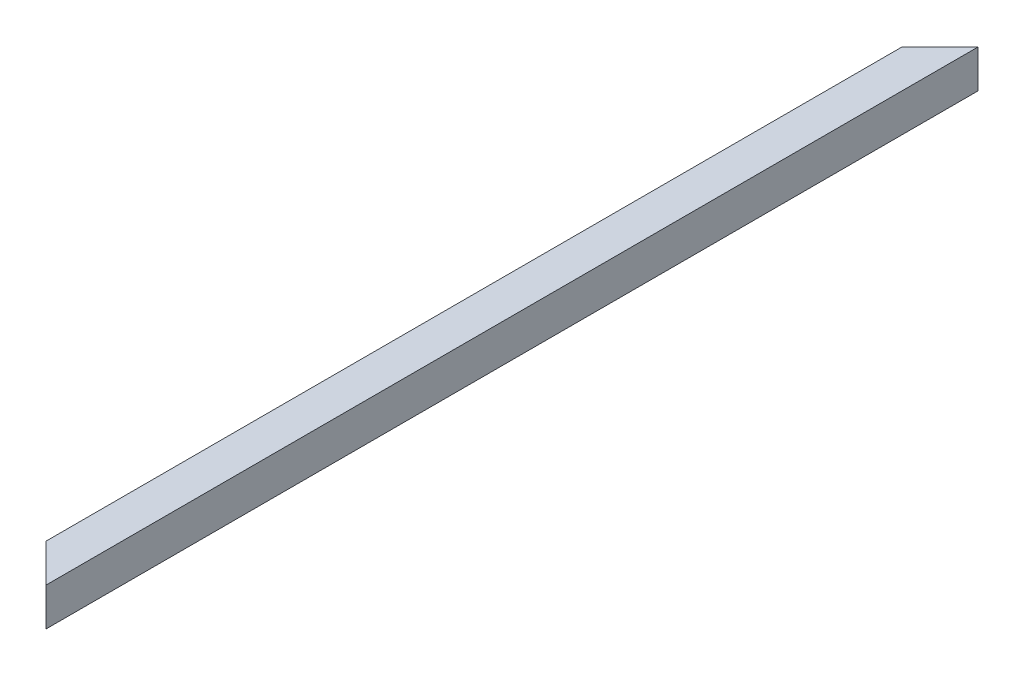
ISO-10303-21;
HEADER;
FILE_DESCRIPTION(('STEP AP214'),'2;1');
FILE_NAME('part.step','',(''),(''),'','','');
FILE_SCHEMA(('AUTOMOTIVE_DESIGN { 1 0 10303 214 1 1 1 1 }'));
ENDSEC;
DATA;
#1=APPLICATION_CONTEXT('core data for automotive mechanical design processes');
#2=APPLICATION_PROTOCOL_DEFINITION('international standard','automotive_design',2000,#1);
#3=PRODUCT_CONTEXT('',#1,'mechanical');
#4=PRODUCT('Part','Part','',(#3));
#5=PRODUCT_RELATED_PRODUCT_CATEGORY('part','',(#4));
#6=PRODUCT_DEFINITION_FORMATION('','',#4);
#7=PRODUCT_DEFINITION_CONTEXT('part definition',#1,'design');
#8=PRODUCT_DEFINITION('design','',#6,#7);
#9=PRODUCT_DEFINITION_SHAPE('','',#8);
#10=(LENGTH_UNIT() NAMED_UNIT(*) SI_UNIT(.MILLI.,.METRE.));
#11=(NAMED_UNIT(*) PLANE_ANGLE_UNIT() SI_UNIT($,.RADIAN.));
#12=(NAMED_UNIT(*) SI_UNIT($,.STERADIAN.) SOLID_ANGLE_UNIT());
#13=UNCERTAINTY_MEASURE_WITH_UNIT(LENGTH_MEASURE(1.E-05),#10,'distance_accuracy_value','');
#14=(GEOMETRIC_REPRESENTATION_CONTEXT(3) GLOBAL_UNCERTAINTY_ASSIGNED_CONTEXT((#13)) GLOBAL_UNIT_ASSIGNED_CONTEXT((#10,
#11,#12)) REPRESENTATION_CONTEXT('',''));
#15=CARTESIAN_POINT('',(0.,0.,0.));
#16=DIRECTION('',(0.,0.,1.));
#17=DIRECTION('',(1.,0.,0.));
#18=AXIS2_PLACEMENT_3D('',#15,#16,#17);
#19=CARTESIAN_POINT('',(-12.7,12.7,-285.75));
#20=DIRECTION('',(0.707106781186547,0.,0.707106781186548));
#21=DIRECTION('',(0.707106781186548,0.,-0.707106781186547));
#22=AXIS2_PLACEMENT_3D('',#19,#20,#21);
#23=PLANE('',#22);
#24=DIRECTION('',(0.707106781186548,0.,-0.707106781186547));
#25=VECTOR('',#24,1.);
#26=CARTESIAN_POINT('',(-77.7875,-12.7,-220.6625));
#27=LINE('',#26,#25);
#28=CARTESIAN_POINT('',(-12.7,-12.7,-285.75));
#29=VERTEX_POINT('',#28);
#30=CARTESIAN_POINT('',(12.7,-12.7,-311.15));
#31=VERTEX_POINT('',#30);
#32=EDGE_CURVE('E35',#29,#31,#27,.T.);
#33=ORIENTED_EDGE('',*,*,#32,.F.);
#34=DIRECTION('',(0.,-1.,0.));
#35=VECTOR('',#34,1.);
#36=CARTESIAN_POINT('',(-12.7,0.,-285.75));
#37=LINE('',#36,#35);
#38=CARTESIAN_POINT('',(-12.7,12.7,-285.75));
#39=VERTEX_POINT('',#38);
#40=EDGE_CURVE('E104',#39,#29,#37,.T.);
#41=ORIENTED_EDGE('',*,*,#40,.F.);
#42=DIRECTION('',(-0.707106781186548,0.,0.707106781186547));
#43=VECTOR('',#42,1.);
#44=CARTESIAN_POINT('',(-84.1375,12.7,-214.3125));
#45=LINE('',#44,#43);
#46=CARTESIAN_POINT('',(12.7,12.7,-311.15));
#47=VERTEX_POINT('',#46);
#48=EDGE_CURVE('E10',#47,#39,#45,.T.);
#49=ORIENTED_EDGE('',*,*,#48,.F.);
#50=DIRECTION('',(0.,1.,0.));
#51=VECTOR('',#50,1.);
#52=CARTESIAN_POINT('',(12.7,12.7,-311.15));
#53=LINE('',#52,#51);
#54=EDGE_CURVE('E114',#31,#47,#53,.T.);
#55=ORIENTED_EDGE('',*,*,#54,.F.);
#56=EDGE_LOOP('',(#33,#41,#49,#55));
#57=FACE_BOUND('',#56,.T.);
#58=DIRECTION('',(0.,1.,0.));
#59=VECTOR('',#58,1.);
#60=CARTESIAN_POINT('',(-9.52500000000001,1.5875,-288.925));
#61=LINE('',#60,#59);
#62=CARTESIAN_POINT('',(-9.525,-9.525,-288.925));
#63=VERTEX_POINT('',#62);
#64=CARTESIAN_POINT('',(-9.525,9.525,-288.925));
#65=VERTEX_POINT('',#64);
#66=EDGE_CURVE('E108',#63,#65,#61,.T.);
#67=ORIENTED_EDGE('',*,*,#66,.F.);
#68=DIRECTION('',(-0.707106781186548,0.,0.707106781186547));
#69=VECTOR('',#68,1.);
#70=CARTESIAN_POINT('',(-78.58125,-9.525,-219.86875));
#71=LINE('',#70,#69);
#72=CARTESIAN_POINT('',(9.525,-9.525,-307.975));
#73=VERTEX_POINT('',#72);
#74=EDGE_CURVE('E145',#73,#63,#71,.T.);
#75=ORIENTED_EDGE('',*,*,#74,.F.);
#76=DIRECTION('',(0.,-1.,0.));
#77=VECTOR('',#76,1.);
#78=CARTESIAN_POINT('',(9.52499999999998,11.1125,-307.975));
#79=LINE('',#78,#77);
#80=CARTESIAN_POINT('',(9.525,9.525,-307.975));
#81=VERTEX_POINT('',#80);
#82=EDGE_CURVE('E130',#81,#73,#79,.T.);
#83=ORIENTED_EDGE('',*,*,#82,.F.);
#84=DIRECTION('',(0.707106781186548,0.,-0.707106781186547));
#85=VECTOR('',#84,1.);
#86=CARTESIAN_POINT('',(-83.34375,9.525,-215.10625));
#87=LINE('',#86,#85);
#88=EDGE_CURVE('E93',#65,#81,#87,.T.);
#89=ORIENTED_EDGE('',*,*,#88,.F.);
#90=EDGE_LOOP('',(#67,#75,#83,#89));
#91=FACE_BOUND('',#90,.T.);
#92=ADVANCED_FACE('F16',(#57,#91),#23,.F.);
#93=CARTESIAN_POINT('',(-12.7,12.7,0.));
#94=DIRECTION('',(0.,1.,0.));
#95=DIRECTION('',(0.,0.,1.));
#96=AXIS2_PLACEMENT_3D('',#93,#94,#95);
#97=PLANE('',#96);
#98=ORIENTED_EDGE('',*,*,#48,.T.);
#99=DIRECTION('',(0.,0.,1.));
#100=VECTOR('',#99,1.);
#101=CARTESIAN_POINT('',(-12.7,12.7,0.));
#102=LINE('',#101,#100);
#103=CARTESIAN_POINT('',(-12.7,12.7,285.75));
#104=VERTEX_POINT('',#103);
#105=EDGE_CURVE('E26',#39,#104,#102,.T.);
#106=ORIENTED_EDGE('',*,*,#105,.T.);
#107=DIRECTION('',(0.707106781186547,0.,0.707106781186548));
#108=VECTOR('',#107,1.);
#109=CARTESIAN_POINT('',(-71.4375,12.7,227.0125));
#110=LINE('',#109,#108);
#111=CARTESIAN_POINT('',(12.7,12.7,311.15));
#112=VERTEX_POINT('',#111);
#113=EDGE_CURVE('E134',#104,#112,#110,.T.);
#114=ORIENTED_EDGE('',*,*,#113,.T.);
#115=DIRECTION('',(0.,0.,-1.));
#116=VECTOR('',#115,1.);
#117=CARTESIAN_POINT('',(12.7,12.7,0.));
#118=LINE('',#117,#116);
#119=EDGE_CURVE('E137',#112,#47,#118,.T.);
#120=ORIENTED_EDGE('',*,*,#119,.T.);
#121=EDGE_LOOP('',(#98,#106,#114,#120));
#122=FACE_BOUND('',#121,.T.);
#123=ADVANCED_FACE('F156',(#122),#97,.T.);
#124=CARTESIAN_POINT('',(9.525,9.525,0.));
#125=DIRECTION('',(1.,0.,0.));
#126=DIRECTION('',(0.,0.,-1.));
#127=AXIS2_PLACEMENT_3D('',#124,#125,#126);
#128=PLANE('',#127);
#129=ORIENTED_EDGE('',*,*,#82,.T.);
#130=DIRECTION('',(0.,0.,1.));
#131=VECTOR('',#130,1.);
#132=CARTESIAN_POINT('',(9.525,-9.525,0.));
#133=LINE('',#132,#131);
#134=CARTESIAN_POINT('',(9.525,-9.525,307.975));
#135=VERTEX_POINT('',#134);
#136=EDGE_CURVE('E140',#73,#135,#133,.T.);
#137=ORIENTED_EDGE('',*,*,#136,.T.);
#138=DIRECTION('',(0.,1.,0.));
#139=VECTOR('',#138,1.);
#140=CARTESIAN_POINT('',(9.52500000000001,11.1125,307.975));
#141=LINE('',#140,#139);
#142=CARTESIAN_POINT('',(9.525,9.525,307.975));
#143=VERTEX_POINT('',#142);
#144=EDGE_CURVE('E143',#135,#143,#141,.T.);
#145=ORIENTED_EDGE('',*,*,#144,.T.);
#146=DIRECTION('',(0.,0.,-1.));
#147=VECTOR('',#146,1.);
#148=CARTESIAN_POINT('',(9.525,9.525,0.));
#149=LINE('',#148,#147);
#150=EDGE_CURVE('E90',#143,#81,#149,.T.);
#151=ORIENTED_EDGE('',*,*,#150,.T.);
#152=EDGE_LOOP('',(#129,#137,#145,#151));
#153=FACE_BOUND('',#152,.T.);
#154=ADVANCED_FACE('F153',(#153),#128,.F.);
#155=CARTESIAN_POINT('',(9.525,-9.525,0.));
#156=DIRECTION('',(0.,-1.,0.));
#157=DIRECTION('',(0.,0.,-1.));
#158=AXIS2_PLACEMENT_3D('',#155,#156,#157);
#159=PLANE('',#158);
#160=ORIENTED_EDGE('',*,*,#74,.T.);
#161=DIRECTION('',(0.,0.,1.));
#162=VECTOR('',#161,1.);
#163=CARTESIAN_POINT('',(-9.525,-9.525,0.));
#164=LINE('',#163,#162);
#165=CARTESIAN_POINT('',(-9.525,-9.525,288.925));
#166=VERTEX_POINT('',#165);
#167=EDGE_CURVE('E146',#63,#166,#164,.T.);
#168=ORIENTED_EDGE('',*,*,#167,.T.);
#169=DIRECTION('',(0.707106781186547,0.,0.707106781186548));
#170=VECTOR('',#169,1.);
#171=CARTESIAN_POINT('',(-65.88125,-9.525,232.56875));
#172=LINE('',#171,#170);
#173=EDGE_CURVE('E100',#166,#135,#172,.T.);
#174=ORIENTED_EDGE('',*,*,#173,.T.);
#175=ORIENTED_EDGE('',*,*,#136,.F.);
#176=EDGE_LOOP('',(#160,#168,#174,#175));
#177=FACE_BOUND('',#176,.T.);
#178=ADVANCED_FACE('F150',(#177),#159,.F.);
#179=CARTESIAN_POINT('',(12.7,12.7,311.15));
#180=DIRECTION('',(0.707106781186548,0.,-0.707106781186547));
#181=DIRECTION('',(-0.707106781186547,0.,-0.707106781186548));
#182=AXIS2_PLACEMENT_3D('',#179,#180,#181);
#183=PLANE('',#182);
#184=DIRECTION('',(-0.707106781186547,0.,-0.707106781186548));
#185=VECTOR('',#184,1.);
#186=CARTESIAN_POINT('',(-65.0875,-12.7,233.3625));
#187=LINE('',#186,#185);
#188=CARTESIAN_POINT('',(12.7,-12.7,311.15));
#189=VERTEX_POINT('',#188);
#190=CARTESIAN_POINT('',(-12.7,-12.7,285.75));
#191=VERTEX_POINT('',#190);
#192=EDGE_CURVE('E78',#189,#191,#187,.T.);
#193=ORIENTED_EDGE('',*,*,#192,.F.);
#194=DIRECTION('',(0.,-1.,0.));
#195=VECTOR('',#194,1.);
#196=CARTESIAN_POINT('',(12.7,12.7,311.15));
#197=LINE('',#196,#195);
#198=EDGE_CURVE('E94',#112,#189,#197,.T.);
#199=ORIENTED_EDGE('',*,*,#198,.F.);
#200=ORIENTED_EDGE('',*,*,#113,.F.);
#201=DIRECTION('',(0.,1.,0.));
#202=VECTOR('',#201,1.);
#203=CARTESIAN_POINT('',(-12.7,0.,285.75));
#204=LINE('',#203,#202);
#205=EDGE_CURVE('E121',#191,#104,#204,.T.);
#206=ORIENTED_EDGE('',*,*,#205,.F.);
#207=EDGE_LOOP('',(#193,#199,#200,#206));
#208=FACE_BOUND('',#207,.T.);
#209=ORIENTED_EDGE('',*,*,#144,.F.);
#210=ORIENTED_EDGE('',*,*,#173,.F.);
#211=DIRECTION('',(0.,-1.,0.));
#212=VECTOR('',#211,1.);
#213=CARTESIAN_POINT('',(-9.525,1.5875,288.925));
#214=LINE('',#213,#212);
#215=CARTESIAN_POINT('',(-9.525,9.525,288.925));
#216=VERTEX_POINT('',#215);
#217=EDGE_CURVE('E97',#216,#166,#214,.T.);
#218=ORIENTED_EDGE('',*,*,#217,.F.);
#219=DIRECTION('',(-0.707106781186547,0.,-0.707106781186548));
#220=VECTOR('',#219,1.);
#221=CARTESIAN_POINT('',(-70.64375,9.525,227.80625));
#222=LINE('',#221,#220);
#223=EDGE_CURVE('E84',#143,#216,#222,.T.);
#224=ORIENTED_EDGE('',*,*,#223,.F.);
#225=EDGE_LOOP('',(#209,#210,#218,#224));
#226=FACE_BOUND('',#225,.T.);
#227=ADVANCED_FACE('F98',(#208,#226),#183,.F.);
#228=CARTESIAN_POINT('',(-9.525,-9.525,0.));
#229=DIRECTION('',(-1.,0.,0.));
#230=DIRECTION('',(0.,0.,1.));
#231=AXIS2_PLACEMENT_3D('',#228,#229,#230);
#232=PLANE('',#231);
#233=ORIENTED_EDGE('',*,*,#66,.T.);
#234=DIRECTION('',(0.,0.,1.));
#235=VECTOR('',#234,1.);
#236=CARTESIAN_POINT('',(-9.525,9.525,0.));
#237=LINE('',#236,#235);
#238=EDGE_CURVE('E88',#65,#216,#237,.T.);
#239=ORIENTED_EDGE('',*,*,#238,.T.);
#240=ORIENTED_EDGE('',*,*,#217,.T.);
#241=ORIENTED_EDGE('',*,*,#167,.F.);
#242=EDGE_LOOP('',(#233,#239,#240,#241));
#243=FACE_BOUND('',#242,.T.);
#244=ADVANCED_FACE('F107',(#243),#232,.F.);
#245=CARTESIAN_POINT('',(-12.7,-12.7,0.));
#246=DIRECTION('',(-1.,0.,0.));
#247=DIRECTION('',(0.,0.,1.));
#248=AXIS2_PLACEMENT_3D('',#245,#246,#247);
#249=PLANE('',#248);
#250=ORIENTED_EDGE('',*,*,#40,.T.);
#251=DIRECTION('',(0.,0.,-1.));
#252=VECTOR('',#251,1.);
#253=CARTESIAN_POINT('',(-12.7,-12.7,0.));
#254=LINE('',#253,#252);
#255=EDGE_CURVE('E111',#191,#29,#254,.T.);
#256=ORIENTED_EDGE('',*,*,#255,.F.);
#257=ORIENTED_EDGE('',*,*,#205,.T.);
#258=ORIENTED_EDGE('',*,*,#105,.F.);
#259=EDGE_LOOP('',(#250,#256,#257,#258));
#260=FACE_BOUND('',#259,.T.);
#261=ADVANCED_FACE('F174',(#260),#249,.T.);
#262=CARTESIAN_POINT('',(-9.525,9.525,0.));
#263=DIRECTION('',(0.,1.,0.));
#264=DIRECTION('',(0.,0.,1.));
#265=AXIS2_PLACEMENT_3D('',#262,#263,#264);
#266=PLANE('',#265);
#267=ORIENTED_EDGE('',*,*,#88,.T.);
#268=ORIENTED_EDGE('',*,*,#150,.F.);
#269=ORIENTED_EDGE('',*,*,#223,.T.);
#270=ORIENTED_EDGE('',*,*,#238,.F.);
#271=EDGE_LOOP('',(#267,#268,#269,#270));
#272=FACE_BOUND('',#271,.T.);
#273=ADVANCED_FACE('F86',(#272),#266,.F.);
#274=CARTESIAN_POINT('',(12.7,12.7,0.));
#275=DIRECTION('',(1.,0.,0.));
#276=DIRECTION('',(0.,0.,-1.));
#277=AXIS2_PLACEMENT_3D('',#274,#275,#276);
#278=PLANE('',#277);
#279=ORIENTED_EDGE('',*,*,#198,.T.);
#280=DIRECTION('',(0.,0.,-1.));
#281=VECTOR('',#280,1.);
#282=CARTESIAN_POINT('',(12.7,-12.7,0.));
#283=LINE('',#282,#281);
#284=EDGE_CURVE('E20',#189,#31,#283,.T.);
#285=ORIENTED_EDGE('',*,*,#284,.T.);
#286=ORIENTED_EDGE('',*,*,#54,.T.);
#287=ORIENTED_EDGE('',*,*,#119,.F.);
#288=EDGE_LOOP('',(#279,#285,#286,#287));
#289=FACE_BOUND('',#288,.T.);
#290=ADVANCED_FACE('F178',(#289),#278,.T.);
#291=CARTESIAN_POINT('',(12.7,-12.7,0.));
#292=DIRECTION('',(0.,-1.,0.));
#293=DIRECTION('',(0.,0.,-1.));
#294=AXIS2_PLACEMENT_3D('',#291,#292,#293);
#295=PLANE('',#294);
#296=ORIENTED_EDGE('',*,*,#32,.T.);
#297=ORIENTED_EDGE('',*,*,#284,.F.);
#298=ORIENTED_EDGE('',*,*,#192,.T.);
#299=ORIENTED_EDGE('',*,*,#255,.T.);
#300=EDGE_LOOP('',(#296,#297,#298,#299));
#301=FACE_BOUND('',#300,.T.);
#302=ADVANCED_FACE('F18',(#301),#295,.T.);
#303=CLOSED_SHELL('',(#92,#123,#154,#178,#227,#244,#261,#273,#290,#302));
#304=MANIFOLD_SOLID_BREP('B1',#303);
#305=ADVANCED_BREP_SHAPE_REPRESENTATION('',(#18,#304),#14);
#306=SHAPE_DEFINITION_REPRESENTATION(#9,#305);
ENDSEC;
END-ISO-10303-21;
